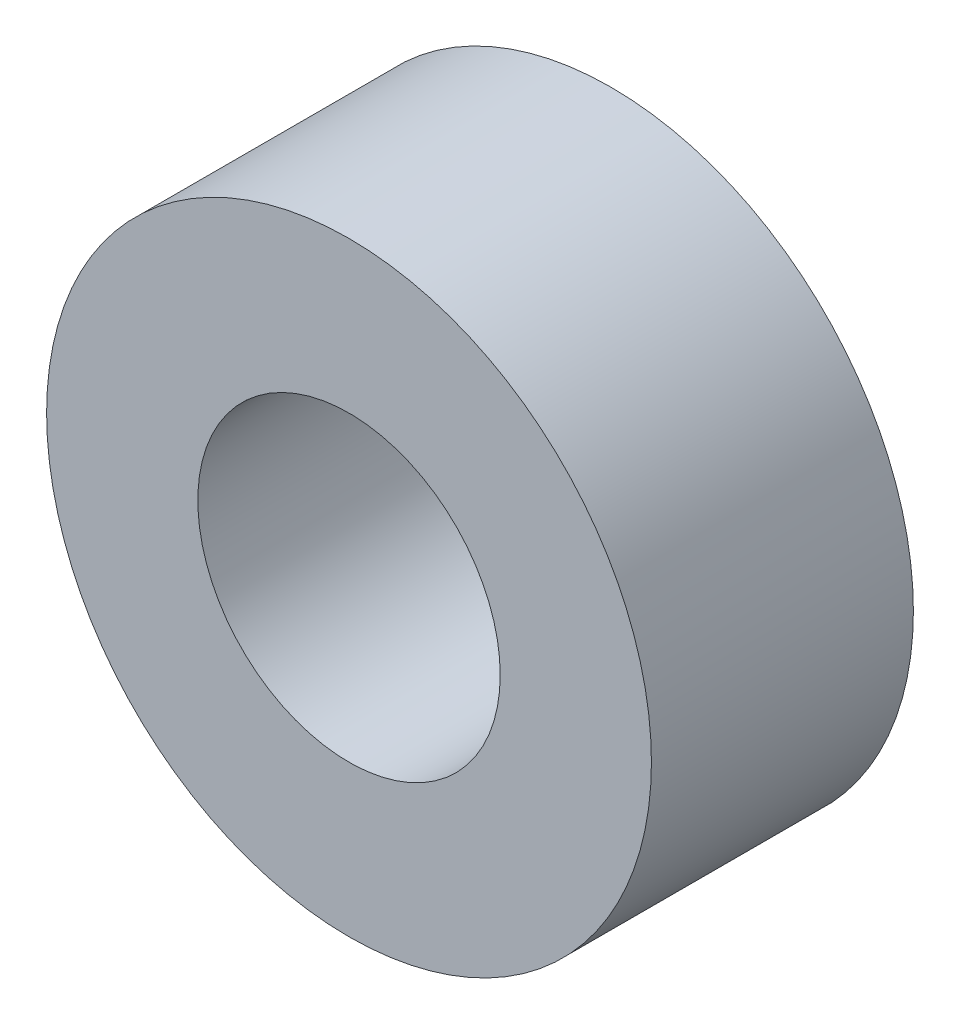
ISO-10303-21;
HEADER;
FILE_DESCRIPTION(('STEP AP214'),'2;1');
FILE_NAME('part.step','',(''),(''),'','','');
FILE_SCHEMA(('AUTOMOTIVE_DESIGN { 1 0 10303 214 1 1 1 1 }'));
ENDSEC;
DATA;
#1=APPLICATION_CONTEXT('core data for automotive mechanical design processes');
#2=APPLICATION_PROTOCOL_DEFINITION('international standard','automotive_design',2000,#1);
#3=PRODUCT_CONTEXT('',#1,'mechanical');
#4=PRODUCT('Part','Part','',(#3));
#5=PRODUCT_RELATED_PRODUCT_CATEGORY('part','',(#4));
#6=PRODUCT_DEFINITION_FORMATION('','',#4);
#7=PRODUCT_DEFINITION_CONTEXT('part definition',#1,'design');
#8=PRODUCT_DEFINITION('design','',#6,#7);
#9=PRODUCT_DEFINITION_SHAPE('','',#8);
#10=(LENGTH_UNIT() NAMED_UNIT(*) SI_UNIT(.MILLI.,.METRE.));
#11=(NAMED_UNIT(*) PLANE_ANGLE_UNIT() SI_UNIT($,.RADIAN.));
#12=(NAMED_UNIT(*) SI_UNIT($,.STERADIAN.) SOLID_ANGLE_UNIT());
#13=UNCERTAINTY_MEASURE_WITH_UNIT(LENGTH_MEASURE(1.E-05),#10,'distance_accuracy_value','');
#14=(GEOMETRIC_REPRESENTATION_CONTEXT(3) GLOBAL_UNCERTAINTY_ASSIGNED_CONTEXT((#13)) GLOBAL_UNIT_ASSIGNED_CONTEXT((#10,
#11,#12)) REPRESENTATION_CONTEXT('',''));
#15=CARTESIAN_POINT('',(0.,0.,0.));
#16=DIRECTION('',(0.,0.,1.));
#17=DIRECTION('',(1.,0.,0.));
#18=AXIS2_PLACEMENT_3D('',#15,#16,#17);
#19=CARTESIAN_POINT('',(0.,0.,0.365));
#20=DIRECTION('',(0.,0.,-1.));
#21=DIRECTION('',(-1.,0.,0.));
#22=AXIS2_PLACEMENT_3D('',#19,#20,#21);
#23=PLANE('',#22);
#24=CARTESIAN_POINT('',(0.,0.,0.365));
#25=DIRECTION('',(0.,0.,1.));
#26=DIRECTION('',(-1.,0.,0.));
#27=AXIS2_PLACEMENT_3D('',#24,#25,#26);
#28=CIRCLE('',#27,2.);
#29=CARTESIAN_POINT('',(2.,0.,0.364999999999983));
#30=VERTEX_POINT('',#29);
#31=EDGE_CURVE('E56',#30,#30,#28,.T.);
#32=ORIENTED_EDGE('',*,*,#31,.F.);
#33=EDGE_LOOP('',(#32));
#34=FACE_BOUND('',#33,.T.);
#35=CARTESIAN_POINT('',(0.,0.,0.365));
#36=DIRECTION('',(0.,0.,-1.));
#37=DIRECTION('',(-1.,0.,0.));
#38=AXIS2_PLACEMENT_3D('',#35,#36,#37);
#39=CIRCLE('',#38,4.);
#40=CARTESIAN_POINT('',(4.,0.,0.364999999999957));
#41=VERTEX_POINT('',#40);
#42=EDGE_CURVE('E11',#41,#41,#39,.T.);
#43=ORIENTED_EDGE('',*,*,#42,.F.);
#44=EDGE_LOOP('',(#43));
#45=FACE_BOUND('',#44,.T.);
#46=ADVANCED_FACE('F16',(#34,#45),#23,.F.);
#47=CARTESIAN_POINT('',(0.,0.,-3.09999999463561));
#48=DIRECTION('',(0.,0.,-1.));
#49=DIRECTION('',(-1.,0.,0.));
#50=AXIS2_PLACEMENT_3D('',#47,#48,#49);
#51=PLANE('',#50);
#52=CARTESIAN_POINT('',(0.,0.,-3.09999999463561));
#53=DIRECTION('',(0.,0.,1.));
#54=DIRECTION('',(-1.,0.,0.));
#55=AXIS2_PLACEMENT_3D('',#52,#53,#54);
#56=CIRCLE('',#55,2.);
#57=CARTESIAN_POINT('',(1.99999999999996,0.,-3.09999999463562));
#58=VERTEX_POINT('',#57);
#59=EDGE_CURVE('E54',#58,#58,#56,.T.);
#60=ORIENTED_EDGE('',*,*,#59,.T.);
#61=EDGE_LOOP('',(#60));
#62=FACE_BOUND('',#61,.T.);
#63=CARTESIAN_POINT('',(0.,0.,-3.09999999463561));
#64=DIRECTION('',(0.,0.,-1.));
#65=DIRECTION('',(-1.,0.,0.));
#66=AXIS2_PLACEMENT_3D('',#63,#64,#65);
#67=CIRCLE('',#66,4.);
#68=CARTESIAN_POINT('',(4.,0.,-3.09999999463565));
#69=VERTEX_POINT('',#68);
#70=EDGE_CURVE('E68',#69,#69,#67,.T.);
#71=ORIENTED_EDGE('',*,*,#70,.T.);
#72=EDGE_LOOP('',(#71));
#73=FACE_BOUND('',#72,.T.);
#74=ADVANCED_FACE('F60',(#62,#73),#51,.T.);
#75=CARTESIAN_POINT('',(0.,0.,0.365));
#76=DIRECTION('',(0.,0.,-1.));
#77=DIRECTION('',(-1.,0.,0.));
#78=AXIS2_PLACEMENT_3D('',#75,#76,#77);
#79=CYLINDRICAL_SURFACE('',#78,4.);
#80=ORIENTED_EDGE('',*,*,#70,.F.);
#81=DIRECTION('',(0.,0.,1.));
#82=VECTOR('',#81,1.);
#83=CARTESIAN_POINT('',(4.,0.,0.364999999999953));
#84=LINE('',#83,#82);
#85=EDGE_CURVE('E24',#69,#41,#84,.T.);
#86=ORIENTED_EDGE('',*,*,#85,.T.);
#87=ORIENTED_EDGE('',*,*,#42,.T.);
#88=ORIENTED_EDGE('',*,*,#85,.F.);
#89=EDGE_LOOP('',(#80,#86,#87,#88));
#90=FACE_BOUND('',#89,.T.);
#91=ADVANCED_FACE('F72',(#90),#79,.T.);
#92=CARTESIAN_POINT('',(0.,0.,0.365));
#93=DIRECTION('',(0.,0.,-1.));
#94=DIRECTION('',(-1.,0.,0.));
#95=AXIS2_PLACEMENT_3D('',#92,#93,#94);
#96=CYLINDRICAL_SURFACE('',#95,2.);
#97=ORIENTED_EDGE('',*,*,#59,.F.);
#98=DIRECTION('',(0.,0.,1.));
#99=VECTOR('',#98,1.);
#100=CARTESIAN_POINT('',(2.,0.,0.364999999999977));
#101=LINE('',#100,#99);
#102=EDGE_CURVE('E51',#58,#30,#101,.T.);
#103=ORIENTED_EDGE('',*,*,#102,.T.);
#104=ORIENTED_EDGE('',*,*,#31,.T.);
#105=ORIENTED_EDGE('',*,*,#102,.F.);
#106=EDGE_LOOP('',(#97,#103,#104,#105));
#107=FACE_BOUND('',#106,.T.);
#108=ADVANCED_FACE('F53',(#107),#96,.F.);
#109=CLOSED_SHELL('',(#46,#74,#91,#108));
#110=MANIFOLD_SOLID_BREP('B1',#109);
#111=ADVANCED_BREP_SHAPE_REPRESENTATION('',(#18,#110),#14);
#112=SHAPE_DEFINITION_REPRESENTATION(#9,#111);
ENDSEC;
END-ISO-10303-21;
